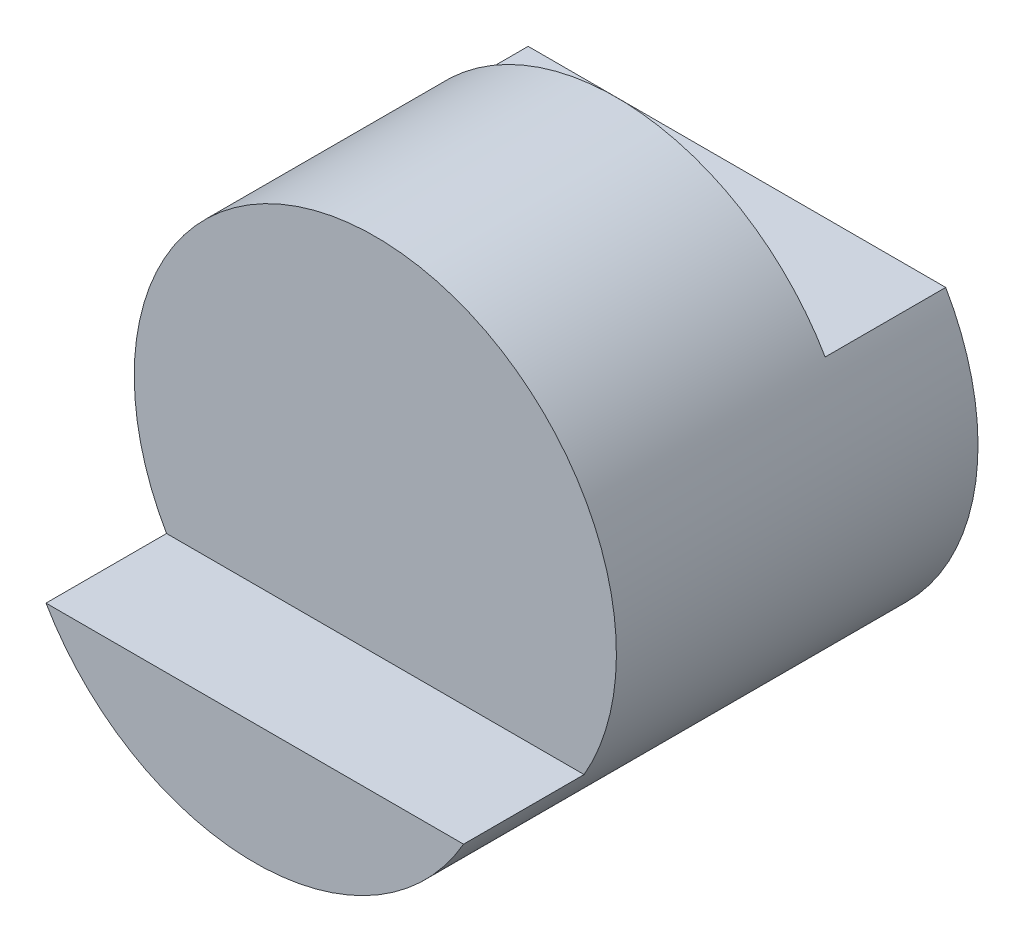
ISO-10303-21;
HEADER;
FILE_DESCRIPTION(('STEP AP214'),'2;1');
FILE_NAME('part.step','',(''),(''),'','','');
FILE_SCHEMA(('AUTOMOTIVE_DESIGN { 1 0 10303 214 1 1 1 1 }'));
ENDSEC;
DATA;
#1=APPLICATION_CONTEXT('core data for automotive mechanical design processes');
#2=APPLICATION_PROTOCOL_DEFINITION('international standard','automotive_design',2000,#1);
#3=PRODUCT_CONTEXT('',#1,'mechanical');
#4=PRODUCT('Part','Part','',(#3));
#5=PRODUCT_RELATED_PRODUCT_CATEGORY('part','',(#4));
#6=PRODUCT_DEFINITION_FORMATION('','',#4);
#7=PRODUCT_DEFINITION_CONTEXT('part definition',#1,'design');
#8=PRODUCT_DEFINITION('design','',#6,#7);
#9=PRODUCT_DEFINITION_SHAPE('','',#8);
#10=(LENGTH_UNIT() NAMED_UNIT(*) SI_UNIT(.MILLI.,.METRE.));
#11=(NAMED_UNIT(*) PLANE_ANGLE_UNIT() SI_UNIT($,.RADIAN.));
#12=(NAMED_UNIT(*) SI_UNIT($,.STERADIAN.) SOLID_ANGLE_UNIT());
#13=UNCERTAINTY_MEASURE_WITH_UNIT(LENGTH_MEASURE(1.E-05),#10,'distance_accuracy_value','');
#14=(GEOMETRIC_REPRESENTATION_CONTEXT(3) GLOBAL_UNCERTAINTY_ASSIGNED_CONTEXT((#13)) GLOBAL_UNIT_ASSIGNED_CONTEXT((#10,
#11,#12)) REPRESENTATION_CONTEXT('',''));
#15=CARTESIAN_POINT('',(0.,0.,0.));
#16=DIRECTION('',(0.,0.,1.));
#17=DIRECTION('',(1.,0.,0.));
#18=AXIS2_PLACEMENT_3D('',#15,#16,#17);
#19=CARTESIAN_POINT('',(0.,0.,3.));
#20=DIRECTION('',(0.,0.,-1.));
#21=DIRECTION('',(-1.,0.,0.));
#22=AXIS2_PLACEMENT_3D('',#19,#20,#21);
#23=CYLINDRICAL_SURFACE('',#22,2.);
#24=CARTESIAN_POINT('',(0.,0.,3.));
#25=DIRECTION('',(0.,0.,1.));
#26=DIRECTION('',(1.,0.,0.));
#27=AXIS2_PLACEMENT_3D('',#24,#25,#26);
#28=CIRCLE('',#27,2.);
#29=CARTESIAN_POINT('',(1.73205080756888,-1.,3.));
#30=VERTEX_POINT('',#29);
#31=CARTESIAN_POINT('',(-1.73205080756888,-1.,3.));
#32=VERTEX_POINT('',#31);
#33=EDGE_CURVE('E11',#30,#32,#28,.T.);
#34=ORIENTED_EDGE('',*,*,#33,.F.);
#35=DIRECTION('',(0.,0.,-1.));
#36=VECTOR('',#35,1.);
#37=CARTESIAN_POINT('',(1.73205080756888,-1.,4.));
#38=LINE('',#37,#36);
#39=CARTESIAN_POINT('',(1.73205080756888,-1.,4.));
#40=VERTEX_POINT('',#39);
#41=EDGE_CURVE('E98',#40,#30,#38,.T.);
#42=ORIENTED_EDGE('',*,*,#41,.F.);
#43=CARTESIAN_POINT('',(0.,0.,4.));
#44=DIRECTION('',(0.,0.,1.));
#45=DIRECTION('',(1.,0.,0.));
#46=AXIS2_PLACEMENT_3D('',#43,#44,#45);
#47=CIRCLE('',#46,2.);
#48=CARTESIAN_POINT('',(-1.73205080756888,-1.,4.));
#49=VERTEX_POINT('',#48);
#50=EDGE_CURVE('E89',#49,#40,#47,.T.);
#51=ORIENTED_EDGE('',*,*,#50,.F.);
#52=DIRECTION('',(0.,0.,-1.));
#53=VECTOR('',#52,1.);
#54=CARTESIAN_POINT('',(-1.73205080756888,-1.,4.));
#55=LINE('',#54,#53);
#56=EDGE_CURVE('E94',#49,#32,#55,.T.);
#57=ORIENTED_EDGE('',*,*,#56,.T.);
#58=EDGE_LOOP('',(#34,#42,#51,#57));
#59=FACE_BOUND('',#58,.T.);
#60=CARTESIAN_POINT('',(0.,0.,1.));
#61=DIRECTION('',(0.,0.,-1.));
#62=DIRECTION('',(-1.,0.,0.));
#63=AXIS2_PLACEMENT_3D('',#60,#61,#62);
#64=CIRCLE('',#63,2.);
#65=CARTESIAN_POINT('',(-1.73205080756888,1.,1.));
#66=VERTEX_POINT('',#65);
#67=CARTESIAN_POINT('',(1.73205080756888,1.,1.));
#68=VERTEX_POINT('',#67);
#69=EDGE_CURVE('E73',#66,#68,#64,.T.);
#70=ORIENTED_EDGE('',*,*,#69,.F.);
#71=DIRECTION('',(0.,0.,-1.));
#72=VECTOR('',#71,1.);
#73=CARTESIAN_POINT('',(-1.73205080756888,1.,1.));
#74=LINE('',#73,#72);
#75=CARTESIAN_POINT('',(-1.73205080756888,1.,0.));
#76=VERTEX_POINT('',#75);
#77=EDGE_CURVE('E81',#66,#76,#74,.T.);
#78=ORIENTED_EDGE('',*,*,#77,.T.);
#79=CARTESIAN_POINT('',(0.,0.,0.));
#80=DIRECTION('',(0.,0.,1.));
#81=DIRECTION('',(1.,0.,0.));
#82=AXIS2_PLACEMENT_3D('',#79,#80,#81);
#83=CIRCLE('',#82,2.);
#84=CARTESIAN_POINT('',(1.73205080756888,1.,0.));
#85=VERTEX_POINT('',#84);
#86=EDGE_CURVE('E36',#76,#85,#83,.T.);
#87=ORIENTED_EDGE('',*,*,#86,.T.);
#88=DIRECTION('',(0.,0.,-1.));
#89=VECTOR('',#88,1.);
#90=CARTESIAN_POINT('',(1.73205080756888,1.,1.));
#91=LINE('',#90,#89);
#92=EDGE_CURVE('E47',#68,#85,#91,.T.);
#93=ORIENTED_EDGE('',*,*,#92,.F.);
#94=EDGE_LOOP('',(#70,#78,#87,#93));
#95=FACE_BOUND('',#94,.T.);
#96=ADVANCED_FACE('F33',(#59,#95),#23,.T.);
#97=CARTESIAN_POINT('',(0.,0.,3.));
#98=DIRECTION('',(0.,0.,1.));
#99=DIRECTION('',(1.,0.,0.));
#100=AXIS2_PLACEMENT_3D('',#97,#98,#99);
#101=PLANE('',#100);
#102=DIRECTION('',(-1.,0.,0.));
#103=VECTOR('',#102,1.);
#104=CARTESIAN_POINT('',(-1.73205080756888,-1.,3.));
#105=LINE('',#104,#103);
#106=EDGE_CURVE('E53',#30,#32,#105,.T.);
#107=ORIENTED_EDGE('',*,*,#106,.F.);
#108=ORIENTED_EDGE('',*,*,#33,.T.);
#109=EDGE_LOOP('',(#107,#108));
#110=FACE_BOUND('',#109,.T.);
#111=ADVANCED_FACE('F106',(#110),#101,.T.);
#112=CARTESIAN_POINT('',(0.,0.,0.));
#113=DIRECTION('',(0.,0.,1.));
#114=DIRECTION('',(1.,0.,0.));
#115=AXIS2_PLACEMENT_3D('',#112,#113,#114);
#116=PLANE('',#115);
#117=ORIENTED_EDGE('',*,*,#86,.F.);
#118=DIRECTION('',(-1.,0.,0.));
#119=VECTOR('',#118,1.);
#120=CARTESIAN_POINT('',(-1.73205080756888,1.,0.));
#121=LINE('',#120,#119);
#122=EDGE_CURVE('E78',#85,#76,#121,.T.);
#123=ORIENTED_EDGE('',*,*,#122,.F.);
#124=EDGE_LOOP('',(#117,#123));
#125=FACE_BOUND('',#124,.T.);
#126=ADVANCED_FACE('F108',(#125),#116,.F.);
#127=CARTESIAN_POINT('',(-1.73205080756888,-1.,4.));
#128=DIRECTION('',(0.,-1.,0.));
#129=DIRECTION('',(0.,0.,-1.));
#130=AXIS2_PLACEMENT_3D('',#127,#128,#129);
#131=PLANE('',#130);
#132=ORIENTED_EDGE('',*,*,#106,.T.);
#133=ORIENTED_EDGE('',*,*,#56,.F.);
#134=DIRECTION('',(-1.,0.,0.));
#135=VECTOR('',#134,1.);
#136=CARTESIAN_POINT('',(-1.73205080756888,-1.,4.));
#137=LINE('',#136,#135);
#138=EDGE_CURVE('E92',#40,#49,#137,.T.);
#139=ORIENTED_EDGE('',*,*,#138,.F.);
#140=ORIENTED_EDGE('',*,*,#41,.T.);
#141=EDGE_LOOP('',(#132,#133,#139,#140));
#142=FACE_BOUND('',#141,.T.);
#143=ADVANCED_FACE('F102',(#142),#131,.F.);
#144=CARTESIAN_POINT('',(0.,0.,4.));
#145=DIRECTION('',(0.,0.,1.));
#146=DIRECTION('',(1.,0.,0.));
#147=AXIS2_PLACEMENT_3D('',#144,#145,#146);
#148=PLANE('',#147);
#149=ORIENTED_EDGE('',*,*,#50,.T.);
#150=ORIENTED_EDGE('',*,*,#138,.T.);
#151=EDGE_LOOP('',(#149,#150));
#152=FACE_BOUND('',#151,.T.);
#153=ADVANCED_FACE('F118',(#152),#148,.T.);
#154=CARTESIAN_POINT('',(-1.73205080756888,1.,1.));
#155=DIRECTION('',(0.,-1.,0.));
#156=DIRECTION('',(1.,0.,0.));
#157=AXIS2_PLACEMENT_3D('',#154,#155,#156);
#158=PLANE('',#157);
#159=ORIENTED_EDGE('',*,*,#122,.T.);
#160=ORIENTED_EDGE('',*,*,#77,.F.);
#161=DIRECTION('',(-1.,0.,0.));
#162=VECTOR('',#161,1.);
#163=CARTESIAN_POINT('',(-1.73205080756888,1.,1.));
#164=LINE('',#163,#162);
#165=EDGE_CURVE('E75',#68,#66,#164,.T.);
#166=ORIENTED_EDGE('',*,*,#165,.F.);
#167=ORIENTED_EDGE('',*,*,#92,.T.);
#168=EDGE_LOOP('',(#159,#160,#166,#167));
#169=FACE_BOUND('',#168,.T.);
#170=ADVANCED_FACE('F80',(#169),#158,.F.);
#171=CARTESIAN_POINT('',(0.,0.,1.));
#172=DIRECTION('',(0.,0.,-1.));
#173=DIRECTION('',(-1.,0.,0.));
#174=AXIS2_PLACEMENT_3D('',#171,#172,#173);
#175=PLANE('',#174);
#176=ORIENTED_EDGE('',*,*,#69,.T.);
#177=ORIENTED_EDGE('',*,*,#165,.T.);
#178=EDGE_LOOP('',(#176,#177));
#179=FACE_BOUND('',#178,.T.);
#180=ADVANCED_FACE('F74',(#179),#175,.T.);
#181=CLOSED_SHELL('',(#96,#111,#126,#143,#153,#170,#180));
#182=MANIFOLD_SOLID_BREP('B2',#181);
#183=ADVANCED_BREP_SHAPE_REPRESENTATION('',(#18,#182),#14);
#184=SHAPE_DEFINITION_REPRESENTATION(#9,#183);
ENDSEC;
END-ISO-10303-21;
